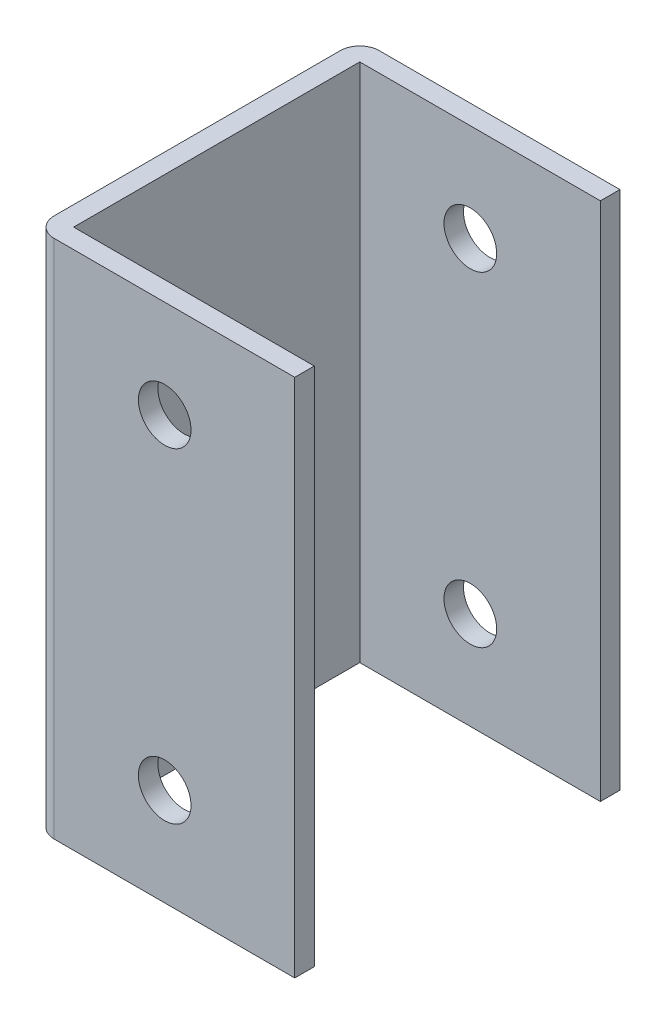
ISO-10303-21;
HEADER;
FILE_DESCRIPTION(('STEP AP214'),'2;1');
FILE_NAME('part.step','',(''),(''),'','','');
FILE_SCHEMA(('AUTOMOTIVE_DESIGN { 1 0 10303 214 1 1 1 1 }'));
ENDSEC;
DATA;
#1=APPLICATION_CONTEXT('core data for automotive mechanical design processes');
#2=APPLICATION_PROTOCOL_DEFINITION('international standard','automotive_design',2000,#1);
#3=PRODUCT_CONTEXT('',#1,'mechanical');
#4=PRODUCT('Part','Part','',(#3));
#5=PRODUCT_RELATED_PRODUCT_CATEGORY('part','',(#4));
#6=PRODUCT_DEFINITION_FORMATION('','',#4);
#7=PRODUCT_DEFINITION_CONTEXT('part definition',#1,'design');
#8=PRODUCT_DEFINITION('design','',#6,#7);
#9=PRODUCT_DEFINITION_SHAPE('','',#8);
#10=(LENGTH_UNIT() NAMED_UNIT(*) SI_UNIT(.MILLI.,.METRE.));
#11=(NAMED_UNIT(*) PLANE_ANGLE_UNIT() SI_UNIT($,.RADIAN.));
#12=(NAMED_UNIT(*) SI_UNIT($,.STERADIAN.) SOLID_ANGLE_UNIT());
#13=UNCERTAINTY_MEASURE_WITH_UNIT(LENGTH_MEASURE(1.E-05),#10,'distance_accuracy_value','');
#14=(GEOMETRIC_REPRESENTATION_CONTEXT(3) GLOBAL_UNCERTAINTY_ASSIGNED_CONTEXT((#13)) GLOBAL_UNIT_ASSIGNED_CONTEXT((#10,
#11,#12)) REPRESENTATION_CONTEXT('',''));
#15=CARTESIAN_POINT('',(0.,0.,0.));
#16=DIRECTION('',(0.,0.,1.));
#17=DIRECTION('',(1.,0.,0.));
#18=AXIS2_PLACEMENT_3D('',#15,#16,#17);
#19=CARTESIAN_POINT('',(-37.,80.,-22.));
#20=DIRECTION('',(0.,1.,0.));
#21=DIRECTION('',(0.,0.,1.));
#22=AXIS2_PLACEMENT_3D('',#19,#20,#21);
#23=PLANE('',#22);
#24=DIRECTION('',(0.,0.,1.));
#25=VECTOR('',#24,1.);
#26=CARTESIAN_POINT('',(0.,80.,27.4206114717656));
#27=LINE('',#26,#25);
#28=CARTESIAN_POINT('',(0.,80.,-25.));
#29=VERTEX_POINT('',#28);
#30=CARTESIAN_POINT('',(0.,80.,-22.));
#31=VERTEX_POINT('',#30);
#32=EDGE_CURVE('E97',#29,#31,#27,.T.);
#33=ORIENTED_EDGE('',*,*,#32,.F.);
#34=DIRECTION('',(-1.,0.,0.));
#35=VECTOR('',#34,1.);
#36=CARTESIAN_POINT('',(-37.,80.,-25.));
#37=LINE('',#36,#35);
#38=CARTESIAN_POINT('',(-37.,80.,-25.));
#39=VERTEX_POINT('',#38);
#40=EDGE_CURVE('E162',#29,#39,#37,.T.);
#41=ORIENTED_EDGE('',*,*,#40,.T.);
#42=CARTESIAN_POINT('',(-37.,80.,-22.));
#43=DIRECTION('',(0.,1.,0.));
#44=DIRECTION('',(0.,0.,1.));
#45=AXIS2_PLACEMENT_3D('',#42,#43,#44);
#46=CIRCLE('',#45,3.);
#47=CARTESIAN_POINT('',(-40.,80.,-22.));
#48=VERTEX_POINT('',#47);
#49=EDGE_CURVE('E193',#39,#48,#46,.T.);
#50=ORIENTED_EDGE('',*,*,#49,.T.);
#51=DIRECTION('',(0.,0.,1.));
#52=VECTOR('',#51,1.);
#53=CARTESIAN_POINT('',(-40.,80.,-22.));
#54=LINE('',#53,#52);
#55=CARTESIAN_POINT('',(-40.,80.,22.));
#56=VERTEX_POINT('',#55);
#57=EDGE_CURVE('E250',#48,#56,#54,.T.);
#58=ORIENTED_EDGE('',*,*,#57,.T.);
#59=CARTESIAN_POINT('',(-37.,80.,22.));
#60=DIRECTION('',(0.,1.,0.));
#61=DIRECTION('',(0.,0.,1.));
#62=AXIS2_PLACEMENT_3D('',#59,#60,#61);
#63=CIRCLE('',#62,3.);
#64=CARTESIAN_POINT('',(-37.,80.,25.));
#65=VERTEX_POINT('',#64);
#66=EDGE_CURVE('E177',#56,#65,#63,.T.);
#67=ORIENTED_EDGE('',*,*,#66,.T.);
#68=DIRECTION('',(1.,0.,0.));
#69=VECTOR('',#68,1.);
#70=CARTESIAN_POINT('',(-37.,80.,25.));
#71=LINE('',#70,#69);
#72=CARTESIAN_POINT('',(0.,80.,25.));
#73=VERTEX_POINT('',#72);
#74=EDGE_CURVE('E172',#65,#73,#71,.T.);
#75=ORIENTED_EDGE('',*,*,#74,.T.);
#76=CARTESIAN_POINT('',(0.,80.,22.));
#77=VERTEX_POINT('',#76);
#78=EDGE_CURVE('E166',#77,#73,#27,.T.);
#79=ORIENTED_EDGE('',*,*,#78,.F.);
#80=DIRECTION('',(1.,0.,0.));
#81=VECTOR('',#80,1.);
#82=CARTESIAN_POINT('',(-37.,80.,22.));
#83=LINE('',#82,#81);
#84=CARTESIAN_POINT('',(-37.,80.,22.));
#85=VERTEX_POINT('',#84);
#86=EDGE_CURVE('E233',#85,#77,#83,.T.);
#87=ORIENTED_EDGE('',*,*,#86,.F.);
#88=DIRECTION('',(0.,0.,1.));
#89=VECTOR('',#88,1.);
#90=CARTESIAN_POINT('',(-37.,80.,-22.));
#91=LINE('',#90,#89);
#92=CARTESIAN_POINT('',(-37.,80.,-22.));
#93=VERTEX_POINT('',#92);
#94=EDGE_CURVE('E231',#93,#85,#91,.T.);
#95=ORIENTED_EDGE('',*,*,#94,.F.);
#96=DIRECTION('',(-1.,0.,0.));
#97=VECTOR('',#96,1.);
#98=CARTESIAN_POINT('',(-37.,80.,-22.));
#99=LINE('',#98,#97);
#100=EDGE_CURVE('E165',#31,#93,#99,.T.);
#101=ORIENTED_EDGE('',*,*,#100,.F.);
#102=EDGE_LOOP('',(#33,#41,#50,#58,#67,#75,#79,#87,#95,#101));
#103=FACE_BOUND('',#102,.T.);
#104=ADVANCED_FACE('F73',(#103),#23,.T.);
#105=CARTESIAN_POINT('',(-37.,0.,-22.));
#106=DIRECTION('',(0.,1.,0.));
#107=DIRECTION('',(0.,0.,1.));
#108=AXIS2_PLACEMENT_3D('',#105,#106,#107);
#109=PLANE('',#108);
#110=DIRECTION('',(-1.,0.,0.));
#111=VECTOR('',#110,1.);
#112=CARTESIAN_POINT('',(-37.,0.,-25.));
#113=LINE('',#112,#111);
#114=CARTESIAN_POINT('',(0.,0.,-25.));
#115=VERTEX_POINT('',#114);
#116=CARTESIAN_POINT('',(-37.,0.,-25.));
#117=VERTEX_POINT('',#116);
#118=EDGE_CURVE('E192',#115,#117,#113,.T.);
#119=ORIENTED_EDGE('',*,*,#118,.F.);
#120=DIRECTION('',(0.,0.,1.));
#121=VECTOR('',#120,1.);
#122=CARTESIAN_POINT('',(0.,0.,27.4206114717656));
#123=LINE('',#122,#121);
#124=CARTESIAN_POINT('',(0.,0.,-22.));
#125=VERTEX_POINT('',#124);
#126=EDGE_CURVE('E152',#115,#125,#123,.T.);
#127=ORIENTED_EDGE('',*,*,#126,.T.);
#128=DIRECTION('',(-1.,0.,0.));
#129=VECTOR('',#128,1.);
#130=CARTESIAN_POINT('',(-37.,0.,-22.));
#131=LINE('',#130,#129);
#132=CARTESIAN_POINT('',(-37.,0.,-22.));
#133=VERTEX_POINT('',#132);
#134=EDGE_CURVE('E234',#125,#133,#131,.T.);
#135=ORIENTED_EDGE('',*,*,#134,.T.);
#136=DIRECTION('',(0.,0.,1.));
#137=VECTOR('',#136,1.);
#138=CARTESIAN_POINT('',(-37.,0.,-22.));
#139=LINE('',#138,#137);
#140=CARTESIAN_POINT('',(-37.,0.,22.));
#141=VERTEX_POINT('',#140);
#142=EDGE_CURVE('E230',#133,#141,#139,.T.);
#143=ORIENTED_EDGE('',*,*,#142,.T.);
#144=DIRECTION('',(1.,0.,0.));
#145=VECTOR('',#144,1.);
#146=CARTESIAN_POINT('',(-37.,0.,22.));
#147=LINE('',#146,#145);
#148=CARTESIAN_POINT('',(0.,0.,22.));
#149=VERTEX_POINT('',#148);
#150=EDGE_CURVE('E241',#141,#149,#147,.T.);
#151=ORIENTED_EDGE('',*,*,#150,.T.);
#152=CARTESIAN_POINT('',(0.,0.,25.));
#153=VERTEX_POINT('',#152);
#154=EDGE_CURVE('E90',#149,#153,#123,.T.);
#155=ORIENTED_EDGE('',*,*,#154,.T.);
#156=DIRECTION('',(1.,0.,0.));
#157=VECTOR('',#156,1.);
#158=CARTESIAN_POINT('',(-37.,0.,25.));
#159=LINE('',#158,#157);
#160=CARTESIAN_POINT('',(-37.,0.,25.));
#161=VERTEX_POINT('',#160);
#162=EDGE_CURVE('E189',#161,#153,#159,.T.);
#163=ORIENTED_EDGE('',*,*,#162,.F.);
#164=CARTESIAN_POINT('',(-37.,0.,22.));
#165=DIRECTION('',(0.,1.,0.));
#166=DIRECTION('',(0.,0.,1.));
#167=AXIS2_PLACEMENT_3D('',#164,#165,#166);
#168=CIRCLE('',#167,3.);
#169=CARTESIAN_POINT('',(-40.,0.,22.));
#170=VERTEX_POINT('',#169);
#171=EDGE_CURVE('E187',#170,#161,#168,.T.);
#172=ORIENTED_EDGE('',*,*,#171,.F.);
#173=DIRECTION('',(0.,0.,1.));
#174=VECTOR('',#173,1.);
#175=CARTESIAN_POINT('',(-40.,0.,-22.));
#176=LINE('',#175,#174);
#177=CARTESIAN_POINT('',(-40.,0.,-22.));
#178=VERTEX_POINT('',#177);
#179=EDGE_CURVE('E184',#178,#170,#176,.T.);
#180=ORIENTED_EDGE('',*,*,#179,.F.);
#181=CARTESIAN_POINT('',(-37.,0.,-22.));
#182=DIRECTION('',(0.,1.,0.));
#183=DIRECTION('',(0.,0.,1.));
#184=AXIS2_PLACEMENT_3D('',#181,#182,#183);
#185=CIRCLE('',#184,3.);
#186=EDGE_CURVE('E181',#117,#178,#185,.T.);
#187=ORIENTED_EDGE('',*,*,#186,.F.);
#188=EDGE_LOOP('',(#119,#127,#135,#143,#151,#155,#163,#172,#180,#187));
#189=FACE_BOUND('',#188,.T.);
#190=ADVANCED_FACE('F264',(#189),#109,.F.);
#191=CARTESIAN_POINT('',(-37.,80.,-22.));
#192=DIRECTION('',(0.,-1.,0.));
#193=DIRECTION('',(0.,0.,-1.));
#194=AXIS2_PLACEMENT_3D('',#191,#192,#193);
#195=CYLINDRICAL_SURFACE('',#194,3.);
#196=ORIENTED_EDGE('',*,*,#186,.T.);
#197=DIRECTION('',(0.,-1.,0.));
#198=VECTOR('',#197,1.);
#199=CARTESIAN_POINT('',(-40.,80.,-22.));
#200=LINE('',#199,#198);
#201=EDGE_CURVE('E82',#48,#178,#200,.T.);
#202=ORIENTED_EDGE('',*,*,#201,.F.);
#203=ORIENTED_EDGE('',*,*,#49,.F.);
#204=DIRECTION('',(0.,-1.,0.));
#205=VECTOR('',#204,1.);
#206=CARTESIAN_POINT('',(-37.,80.,-25.));
#207=LINE('',#206,#205);
#208=EDGE_CURVE('E170',#39,#117,#207,.T.);
#209=ORIENTED_EDGE('',*,*,#208,.T.);
#210=EDGE_LOOP('',(#196,#202,#203,#209));
#211=FACE_BOUND('',#210,.T.);
#212=ADVANCED_FACE('F75',(#211),#195,.T.);
#213=CARTESIAN_POINT('',(-40.,80.,-22.));
#214=DIRECTION('',(1.,0.,0.));
#215=DIRECTION('',(0.,0.,-1.));
#216=AXIS2_PLACEMENT_3D('',#213,#214,#215);
#217=PLANE('',#216);
#218=ORIENTED_EDGE('',*,*,#179,.T.);
#219=DIRECTION('',(0.,-1.,0.));
#220=VECTOR('',#219,1.);
#221=CARTESIAN_POINT('',(-40.,80.,22.));
#222=LINE('',#221,#220);
#223=EDGE_CURVE('E197',#56,#170,#222,.T.);
#224=ORIENTED_EDGE('',*,*,#223,.F.);
#225=ORIENTED_EDGE('',*,*,#57,.F.);
#226=ORIENTED_EDGE('',*,*,#201,.T.);
#227=EDGE_LOOP('',(#218,#224,#225,#226));
#228=FACE_BOUND('',#227,.T.);
#229=ADVANCED_FACE('F280',(#228),#217,.F.);
#230=CARTESIAN_POINT('',(-37.,80.,22.));
#231=DIRECTION('',(0.,-1.,0.));
#232=DIRECTION('',(0.,0.,-1.));
#233=AXIS2_PLACEMENT_3D('',#230,#231,#232);
#234=CYLINDRICAL_SURFACE('',#233,3.);
#235=ORIENTED_EDGE('',*,*,#171,.T.);
#236=DIRECTION('',(0.,-1.,0.));
#237=VECTOR('',#236,1.);
#238=CARTESIAN_POINT('',(-37.,80.,25.));
#239=LINE('',#238,#237);
#240=EDGE_CURVE('E174',#65,#161,#239,.T.);
#241=ORIENTED_EDGE('',*,*,#240,.F.);
#242=ORIENTED_EDGE('',*,*,#66,.F.);
#243=ORIENTED_EDGE('',*,*,#223,.T.);
#244=EDGE_LOOP('',(#235,#241,#242,#243));
#245=FACE_BOUND('',#244,.T.);
#246=ADVANCED_FACE('F257',(#245),#234,.T.);
#247=CARTESIAN_POINT('',(-37.,80.,25.));
#248=DIRECTION('',(0.,0.,-1.));
#249=DIRECTION('',(-1.,0.,0.));
#250=AXIS2_PLACEMENT_3D('',#247,#248,#249);
#251=PLANE('',#250);
#252=CARTESIAN_POINT('',(-20.,15.,25.));
#253=DIRECTION('',(0.,0.,-1.));
#254=DIRECTION('',(-1.,0.,0.));
#255=AXIS2_PLACEMENT_3D('',#252,#253,#254);
#256=CIRCLE('',#255,4.05000000000002);
#257=CARTESIAN_POINT('',(-24.05,15.,25.));
#258=VERTEX_POINT('',#257);
#259=EDGE_CURVE('E204',#258,#258,#256,.T.);
#260=ORIENTED_EDGE('',*,*,#259,.T.);
#261=EDGE_LOOP('',(#260));
#262=FACE_BOUND('',#261,.T.);
#263=CARTESIAN_POINT('',(-19.9999999999998,65.,25.));
#264=DIRECTION('',(0.,0.,-1.));
#265=DIRECTION('',(-1.,0.,0.));
#266=AXIS2_PLACEMENT_3D('',#263,#264,#265);
#267=CIRCLE('',#266,4.05000000000002);
#268=CARTESIAN_POINT('',(-24.0499999999998,65.,25.));
#269=VERTEX_POINT('',#268);
#270=EDGE_CURVE('E215',#269,#269,#267,.T.);
#271=ORIENTED_EDGE('',*,*,#270,.T.);
#272=EDGE_LOOP('',(#271));
#273=FACE_BOUND('',#272,.T.);
#274=ORIENTED_EDGE('',*,*,#162,.T.);
#275=DIRECTION('',(0.,1.,0.));
#276=VECTOR('',#275,1.);
#277=CARTESIAN_POINT('',(0.,80.,25.));
#278=LINE('',#277,#276);
#279=EDGE_CURVE('E156',#153,#73,#278,.T.);
#280=ORIENTED_EDGE('',*,*,#279,.T.);
#281=ORIENTED_EDGE('',*,*,#74,.F.);
#282=ORIENTED_EDGE('',*,*,#240,.T.);
#283=EDGE_LOOP('',(#274,#280,#281,#282));
#284=FACE_BOUND('',#283,.T.);
#285=ADVANCED_FACE('F261',(#262,#273,#284),#251,.F.);
#286=CARTESIAN_POINT('',(-37.,80.,-25.));
#287=DIRECTION('',(0.,0.,1.));
#288=DIRECTION('',(1.,0.,0.));
#289=AXIS2_PLACEMENT_3D('',#286,#287,#288);
#290=PLANE('',#289);
#291=CARTESIAN_POINT('',(-20.,15.,-25.));
#292=DIRECTION('',(0.,0.,-1.));
#293=DIRECTION('',(-1.,0.,0.));
#294=AXIS2_PLACEMENT_3D('',#291,#292,#293);
#295=CIRCLE('',#294,4.05000000000002);
#296=CARTESIAN_POINT('',(-24.05,15.,-25.));
#297=VERTEX_POINT('',#296);
#298=EDGE_CURVE('E210',#297,#297,#295,.T.);
#299=ORIENTED_EDGE('',*,*,#298,.F.);
#300=EDGE_LOOP('',(#299));
#301=FACE_BOUND('',#300,.T.);
#302=CARTESIAN_POINT('',(-19.9999999999998,65.,-25.));
#303=DIRECTION('',(0.,0.,-1.));
#304=DIRECTION('',(-1.,0.,0.));
#305=AXIS2_PLACEMENT_3D('',#302,#303,#304);
#306=CIRCLE('',#305,4.05000000000002);
#307=CARTESIAN_POINT('',(-24.0499999999998,65.,-25.));
#308=VERTEX_POINT('',#307);
#309=EDGE_CURVE('E220',#308,#308,#306,.T.);
#310=ORIENTED_EDGE('',*,*,#309,.F.);
#311=EDGE_LOOP('',(#310));
#312=FACE_BOUND('',#311,.T.);
#313=ORIENTED_EDGE('',*,*,#40,.F.);
#314=DIRECTION('',(0.,-1.,0.));
#315=VECTOR('',#314,1.);
#316=CARTESIAN_POINT('',(0.,80.,-25.));
#317=LINE('',#316,#315);
#318=EDGE_CURVE('E149',#29,#115,#317,.T.);
#319=ORIENTED_EDGE('',*,*,#318,.T.);
#320=ORIENTED_EDGE('',*,*,#118,.T.);
#321=ORIENTED_EDGE('',*,*,#208,.F.);
#322=EDGE_LOOP('',(#313,#319,#320,#321));
#323=FACE_BOUND('',#322,.T.);
#324=ADVANCED_FACE('F168',(#301,#312,#323),#290,.F.);
#325=CARTESIAN_POINT('',(-37.,80.,-22.));
#326=DIRECTION('',(1.,0.,0.));
#327=DIRECTION('',(0.,0.,-1.));
#328=AXIS2_PLACEMENT_3D('',#325,#326,#327);
#329=PLANE('',#328);
#330=ORIENTED_EDGE('',*,*,#142,.F.);
#331=DIRECTION('',(0.,-1.,0.));
#332=VECTOR('',#331,1.);
#333=CARTESIAN_POINT('',(-37.,80.,-22.));
#334=LINE('',#333,#332);
#335=EDGE_CURVE('E238',#93,#133,#334,.T.);
#336=ORIENTED_EDGE('',*,*,#335,.F.);
#337=ORIENTED_EDGE('',*,*,#94,.T.);
#338=DIRECTION('',(0.,-1.,0.));
#339=VECTOR('',#338,1.);
#340=CARTESIAN_POINT('',(-37.,80.,22.));
#341=LINE('',#340,#339);
#342=EDGE_CURVE('E185',#85,#141,#341,.T.);
#343=ORIENTED_EDGE('',*,*,#342,.T.);
#344=EDGE_LOOP('',(#330,#336,#337,#343));
#345=FACE_BOUND('',#344,.T.);
#346=ADVANCED_FACE('F271',(#345),#329,.T.);
#347=CARTESIAN_POINT('',(-37.,80.,22.));
#348=DIRECTION('',(0.,0.,-1.));
#349=DIRECTION('',(-1.,0.,0.));
#350=AXIS2_PLACEMENT_3D('',#347,#348,#349);
#351=PLANE('',#350);
#352=CARTESIAN_POINT('',(-20.,15.,22.));
#353=DIRECTION('',(0.,0.,-1.));
#354=DIRECTION('',(-1.,0.,0.));
#355=AXIS2_PLACEMENT_3D('',#352,#353,#354);
#356=CIRCLE('',#355,4.05000000000002);
#357=CARTESIAN_POINT('',(-24.05,15.,22.));
#358=VERTEX_POINT('',#357);
#359=EDGE_CURVE('E223',#358,#358,#356,.T.);
#360=ORIENTED_EDGE('',*,*,#359,.F.);
#361=EDGE_LOOP('',(#360));
#362=FACE_BOUND('',#361,.T.);
#363=CARTESIAN_POINT('',(-19.9999999999998,65.,22.));
#364=DIRECTION('',(0.,0.,-1.));
#365=DIRECTION('',(-1.,0.,0.));
#366=AXIS2_PLACEMENT_3D('',#363,#364,#365);
#367=CIRCLE('',#366,4.05000000000002);
#368=CARTESIAN_POINT('',(-24.0499999999998,65.,22.));
#369=VERTEX_POINT('',#368);
#370=EDGE_CURVE('E203',#369,#369,#367,.T.);
#371=ORIENTED_EDGE('',*,*,#370,.F.);
#372=EDGE_LOOP('',(#371));
#373=FACE_BOUND('',#372,.T.);
#374=DIRECTION('',(0.,1.,0.));
#375=VECTOR('',#374,1.);
#376=CARTESIAN_POINT('',(0.,80.,22.));
#377=LINE('',#376,#375);
#378=EDGE_CURVE('E157',#149,#77,#377,.T.);
#379=ORIENTED_EDGE('',*,*,#378,.F.);
#380=ORIENTED_EDGE('',*,*,#150,.F.);
#381=ORIENTED_EDGE('',*,*,#342,.F.);
#382=ORIENTED_EDGE('',*,*,#86,.T.);
#383=EDGE_LOOP('',(#379,#380,#381,#382));
#384=FACE_BOUND('',#383,.T.);
#385=ADVANCED_FACE('F268',(#362,#373,#384),#351,.T.);
#386=CARTESIAN_POINT('',(-37.,80.,-22.));
#387=DIRECTION('',(0.,0.,1.));
#388=DIRECTION('',(1.,0.,0.));
#389=AXIS2_PLACEMENT_3D('',#386,#387,#388);
#390=PLANE('',#389);
#391=CARTESIAN_POINT('',(-20.,15.,-22.));
#392=DIRECTION('',(0.,0.,1.));
#393=DIRECTION('',(1.,0.,0.));
#394=AXIS2_PLACEMENT_3D('',#391,#392,#393);
#395=CIRCLE('',#394,4.05000000000002);
#396=CARTESIAN_POINT('',(-15.95,15.,-22.));
#397=VERTEX_POINT('',#396);
#398=EDGE_CURVE('E77',#397,#397,#395,.T.);
#399=ORIENTED_EDGE('',*,*,#398,.F.);
#400=EDGE_LOOP('',(#399));
#401=FACE_BOUND('',#400,.T.);
#402=CARTESIAN_POINT('',(-19.9999999999998,65.,-22.));
#403=DIRECTION('',(0.,0.,1.));
#404=DIRECTION('',(1.,0.,0.));
#405=AXIS2_PLACEMENT_3D('',#402,#403,#404);
#406=CIRCLE('',#405,4.05000000000002);
#407=CARTESIAN_POINT('',(-15.9499999999998,65.,-22.));
#408=VERTEX_POINT('',#407);
#409=EDGE_CURVE('E201',#408,#408,#406,.T.);
#410=ORIENTED_EDGE('',*,*,#409,.F.);
#411=EDGE_LOOP('',(#410));
#412=FACE_BOUND('',#411,.T.);
#413=DIRECTION('',(0.,-1.,0.));
#414=VECTOR('',#413,1.);
#415=CARTESIAN_POINT('',(0.,80.,-22.));
#416=LINE('',#415,#414);
#417=EDGE_CURVE('E12',#31,#125,#416,.T.);
#418=ORIENTED_EDGE('',*,*,#417,.F.);
#419=ORIENTED_EDGE('',*,*,#100,.T.);
#420=ORIENTED_EDGE('',*,*,#335,.T.);
#421=ORIENTED_EDGE('',*,*,#134,.F.);
#422=EDGE_LOOP('',(#418,#419,#420,#421));
#423=FACE_BOUND('',#422,.T.);
#424=ADVANCED_FACE('F275',(#401,#412,#423),#390,.T.);
#425=CARTESIAN_POINT('',(0.,0.,27.4206114717656));
#426=DIRECTION('',(-1.,0.,0.));
#427=DIRECTION('',(0.,0.,1.));
#428=AXIS2_PLACEMENT_3D('',#425,#426,#427);
#429=PLANE('',#428);
#430=ORIENTED_EDGE('',*,*,#32,.T.);
#431=ORIENTED_EDGE('',*,*,#417,.T.);
#432=ORIENTED_EDGE('',*,*,#126,.F.);
#433=ORIENTED_EDGE('',*,*,#318,.F.);
#434=EDGE_LOOP('',(#430,#431,#432,#433));
#435=FACE_BOUND('',#434,.T.);
#436=ADVANCED_FACE('F150',(#435),#429,.F.);
#437=ORIENTED_EDGE('',*,*,#154,.F.);
#438=ORIENTED_EDGE('',*,*,#378,.T.);
#439=ORIENTED_EDGE('',*,*,#78,.T.);
#440=ORIENTED_EDGE('',*,*,#279,.F.);
#441=EDGE_LOOP('',(#437,#438,#439,#440));
#442=FACE_BOUND('',#441,.T.);
#443=ADVANCED_FACE('F262',(#442),#429,.F.);
#444=CARTESIAN_POINT('',(-19.9999999999998,65.,25.));
#445=DIRECTION('',(0.,0.,-1.));
#446=DIRECTION('',(-1.,0.,0.));
#447=AXIS2_PLACEMENT_3D('',#444,#445,#446);
#448=CYLINDRICAL_SURFACE('',#447,4.05000000000002);
#449=ORIENTED_EDGE('',*,*,#409,.T.);
#450=EDGE_LOOP('',(#449));
#451=FACE_BOUND('',#450,.T.);
#452=ORIENTED_EDGE('',*,*,#309,.T.);
#453=EDGE_LOOP('',(#452));
#454=FACE_BOUND('',#453,.T.);
#455=ADVANCED_FACE('F311',(#451,#454),#448,.F.);
#456=CARTESIAN_POINT('',(-20.,15.,25.));
#457=DIRECTION('',(0.,0.,-1.));
#458=DIRECTION('',(-1.,0.,0.));
#459=AXIS2_PLACEMENT_3D('',#456,#457,#458);
#460=CYLINDRICAL_SURFACE('',#459,4.05000000000002);
#461=ORIENTED_EDGE('',*,*,#398,.T.);
#462=EDGE_LOOP('',(#461));
#463=FACE_BOUND('',#462,.T.);
#464=ORIENTED_EDGE('',*,*,#298,.T.);
#465=EDGE_LOOP('',(#464));
#466=FACE_BOUND('',#465,.T.);
#467=ADVANCED_FACE('F308',(#463,#466),#460,.F.);
#468=ORIENTED_EDGE('',*,*,#370,.T.);
#469=EDGE_LOOP('',(#468));
#470=FACE_BOUND('',#469,.T.);
#471=ORIENTED_EDGE('',*,*,#270,.F.);
#472=EDGE_LOOP('',(#471));
#473=FACE_BOUND('',#472,.T.);
#474=ADVANCED_FACE('F305',(#470,#473),#448,.F.);
#475=ORIENTED_EDGE('',*,*,#359,.T.);
#476=EDGE_LOOP('',(#475));
#477=FACE_BOUND('',#476,.T.);
#478=ORIENTED_EDGE('',*,*,#259,.F.);
#479=EDGE_LOOP('',(#478));
#480=FACE_BOUND('',#479,.T.);
#481=ADVANCED_FACE('F307',(#477,#480),#460,.F.);
#482=CLOSED_SHELL('',(#104,#190,#212,#229,#246,#285,#324,#346,#385,#424,#436,#443,#455,#467,
#474,#481));
#483=MANIFOLD_SOLID_BREP('B2',#482);
#484=ADVANCED_BREP_SHAPE_REPRESENTATION('',(#18,#483),#14);
#485=SHAPE_DEFINITION_REPRESENTATION(#9,#484);
ENDSEC;
END-ISO-10303-21;
